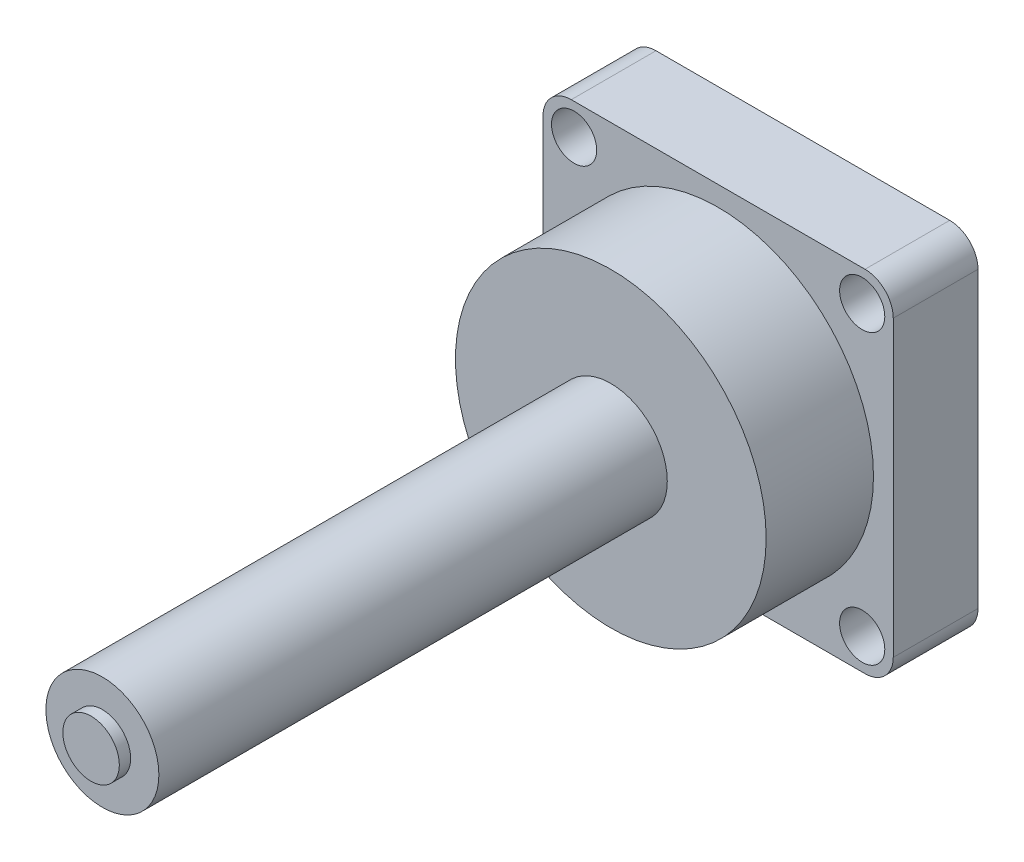
ISO-10303-21;
HEADER;
FILE_DESCRIPTION(('STEP AP214'),'2;1');
FILE_NAME('part.step','',(''),(''),'','','');
FILE_SCHEMA(('AUTOMOTIVE_DESIGN { 1 0 10303 214 1 1 1 1 }'));
ENDSEC;
DATA;
#1=APPLICATION_CONTEXT('core data for automotive mechanical design processes');
#2=APPLICATION_PROTOCOL_DEFINITION('international standard','automotive_design',2000,#1);
#3=PRODUCT_CONTEXT('',#1,'mechanical');
#4=PRODUCT('Part','Part','',(#3));
#5=PRODUCT_RELATED_PRODUCT_CATEGORY('part','',(#4));
#6=PRODUCT_DEFINITION_FORMATION('','',#4);
#7=PRODUCT_DEFINITION_CONTEXT('part definition',#1,'design');
#8=PRODUCT_DEFINITION('design','',#6,#7);
#9=PRODUCT_DEFINITION_SHAPE('','',#8);
#10=(LENGTH_UNIT() NAMED_UNIT(*) SI_UNIT(.MILLI.,.METRE.));
#11=(NAMED_UNIT(*) PLANE_ANGLE_UNIT() SI_UNIT($,.RADIAN.));
#12=(NAMED_UNIT(*) SI_UNIT($,.STERADIAN.) SOLID_ANGLE_UNIT());
#13=UNCERTAINTY_MEASURE_WITH_UNIT(LENGTH_MEASURE(1.E-05),#10,'distance_accuracy_value','');
#14=(GEOMETRIC_REPRESENTATION_CONTEXT(3) GLOBAL_UNCERTAINTY_ASSIGNED_CONTEXT((#13)) GLOBAL_UNIT_ASSIGNED_CONTEXT((#10,
#11,#12)) REPRESENTATION_CONTEXT('',''));
#15=CARTESIAN_POINT('',(0.,0.,0.));
#16=DIRECTION('',(0.,0.,1.));
#17=DIRECTION('',(1.,0.,0.));
#18=AXIS2_PLACEMENT_3D('',#15,#16,#17);
#19=CARTESIAN_POINT('',(0.,31.,15.));
#20=DIRECTION('',(0.,1.,0.));
#21=DIRECTION('',(0.,0.,1.));
#22=AXIS2_PLACEMENT_3D('',#19,#20,#21);
#23=PLANE('',#22);
#24=DIRECTION('',(1.,0.,0.));
#25=VECTOR('',#24,1.);
#26=CARTESIAN_POINT('',(0.,31.,0.));
#27=LINE('',#26,#25);
#28=CARTESIAN_POINT('',(-26.,31.,0.));
#29=VERTEX_POINT('',#28);
#30=CARTESIAN_POINT('',(26.,31.,0.));
#31=VERTEX_POINT('',#30);
#32=EDGE_CURVE('E167',#29,#31,#27,.T.);
#33=ORIENTED_EDGE('',*,*,#32,.F.);
#34=DIRECTION('',(0.,0.,-1.));
#35=VECTOR('',#34,1.);
#36=CARTESIAN_POINT('',(-26.,31.,15.));
#37=LINE('',#36,#35);
#38=CARTESIAN_POINT('',(-26.,31.,15.));
#39=VERTEX_POINT('',#38);
#40=EDGE_CURVE('E47',#39,#29,#37,.T.);
#41=ORIENTED_EDGE('',*,*,#40,.F.);
#42=DIRECTION('',(1.,0.,0.));
#43=VECTOR('',#42,1.);
#44=CARTESIAN_POINT('',(0.,31.,15.));
#45=LINE('',#44,#43);
#46=CARTESIAN_POINT('',(26.,31.,15.));
#47=VERTEX_POINT('',#46);
#48=EDGE_CURVE('E298',#39,#47,#45,.T.);
#49=ORIENTED_EDGE('',*,*,#48,.T.);
#50=DIRECTION('',(0.,0.,-1.));
#51=VECTOR('',#50,1.);
#52=CARTESIAN_POINT('',(26.,31.,15.));
#53=LINE('',#52,#51);
#54=EDGE_CURVE('E98',#47,#31,#53,.T.);
#55=ORIENTED_EDGE('',*,*,#54,.T.);
#56=EDGE_LOOP('',(#33,#41,#49,#55));
#57=FACE_BOUND('',#56,.T.);
#58=ADVANCED_FACE('F43',(#57),#23,.T.);
#59=CARTESIAN_POINT('',(-26.,26.,15.));
#60=DIRECTION('',(0.,0.,-1.));
#61=DIRECTION('',(-1.,0.,0.));
#62=AXIS2_PLACEMENT_3D('',#59,#60,#61);
#63=CYLINDRICAL_SURFACE('',#62,5.);
#64=CARTESIAN_POINT('',(-26.,26.,0.));
#65=DIRECTION('',(0.,0.,1.));
#66=DIRECTION('',(1.,0.,0.));
#67=AXIS2_PLACEMENT_3D('',#64,#65,#66);
#68=CIRCLE('',#67,5.);
#69=CARTESIAN_POINT('',(-31.,26.,0.));
#70=VERTEX_POINT('',#69);
#71=EDGE_CURVE('E170',#29,#70,#68,.T.);
#72=ORIENTED_EDGE('',*,*,#71,.T.);
#73=DIRECTION('',(0.,0.,-1.));
#74=VECTOR('',#73,1.);
#75=CARTESIAN_POINT('',(-31.,26.,15.));
#76=LINE('',#75,#74);
#77=CARTESIAN_POINT('',(-31.,26.,15.));
#78=VERTEX_POINT('',#77);
#79=EDGE_CURVE('E214',#78,#70,#76,.T.);
#80=ORIENTED_EDGE('',*,*,#79,.F.);
#81=CARTESIAN_POINT('',(-26.,26.,15.));
#82=DIRECTION('',(0.,0.,1.));
#83=DIRECTION('',(1.,0.,0.));
#84=AXIS2_PLACEMENT_3D('',#81,#82,#83);
#85=CIRCLE('',#84,5.);
#86=EDGE_CURVE('E224',#39,#78,#85,.T.);
#87=ORIENTED_EDGE('',*,*,#86,.F.);
#88=ORIENTED_EDGE('',*,*,#40,.T.);
#89=EDGE_LOOP('',(#72,#80,#87,#88));
#90=FACE_BOUND('',#89,.T.);
#91=ADVANCED_FACE('F223',(#90),#63,.T.);
#92=CARTESIAN_POINT('',(-31.,0.,15.));
#93=DIRECTION('',(-1.,0.,0.));
#94=DIRECTION('',(0.,0.,1.));
#95=AXIS2_PLACEMENT_3D('',#92,#93,#94);
#96=PLANE('',#95);
#97=DIRECTION('',(0.,1.,0.));
#98=VECTOR('',#97,1.);
#99=CARTESIAN_POINT('',(-31.,0.,0.));
#100=LINE('',#99,#98);
#101=CARTESIAN_POINT('',(-31.,-26.,0.));
#102=VERTEX_POINT('',#101);
#103=EDGE_CURVE('E174',#102,#70,#100,.T.);
#104=ORIENTED_EDGE('',*,*,#103,.F.);
#105=DIRECTION('',(0.,0.,-1.));
#106=VECTOR('',#105,1.);
#107=CARTESIAN_POINT('',(-31.,-26.,15.));
#108=LINE('',#107,#106);
#109=CARTESIAN_POINT('',(-31.,-26.,15.));
#110=VERTEX_POINT('',#109);
#111=EDGE_CURVE('E212',#110,#102,#108,.T.);
#112=ORIENTED_EDGE('',*,*,#111,.F.);
#113=DIRECTION('',(0.,1.,0.));
#114=VECTOR('',#113,1.);
#115=CARTESIAN_POINT('',(-31.,0.,15.));
#116=LINE('',#115,#114);
#117=EDGE_CURVE('E292',#110,#78,#116,.T.);
#118=ORIENTED_EDGE('',*,*,#117,.T.);
#119=ORIENTED_EDGE('',*,*,#79,.T.);
#120=EDGE_LOOP('',(#104,#112,#118,#119));
#121=FACE_BOUND('',#120,.T.);
#122=ADVANCED_FACE('F233',(#121),#96,.T.);
#123=CARTESIAN_POINT('',(-26.,-26.,15.));
#124=DIRECTION('',(0.,0.,-1.));
#125=DIRECTION('',(-1.,0.,0.));
#126=AXIS2_PLACEMENT_3D('',#123,#124,#125);
#127=CYLINDRICAL_SURFACE('',#126,5.);
#128=CARTESIAN_POINT('',(-26.,-26.,0.));
#129=DIRECTION('',(0.,0.,1.));
#130=DIRECTION('',(1.,0.,0.));
#131=AXIS2_PLACEMENT_3D('',#128,#129,#130);
#132=CIRCLE('',#131,5.);
#133=CARTESIAN_POINT('',(-26.,-31.,0.));
#134=VERTEX_POINT('',#133);
#135=EDGE_CURVE('E178',#102,#134,#132,.T.);
#136=ORIENTED_EDGE('',*,*,#135,.T.);
#137=DIRECTION('',(0.,0.,-1.));
#138=VECTOR('',#137,1.);
#139=CARTESIAN_POINT('',(-26.,-31.,15.));
#140=LINE('',#139,#138);
#141=CARTESIAN_POINT('',(-26.,-31.,15.));
#142=VERTEX_POINT('',#141);
#143=EDGE_CURVE('E208',#142,#134,#140,.T.);
#144=ORIENTED_EDGE('',*,*,#143,.F.);
#145=CARTESIAN_POINT('',(-26.,-26.,15.));
#146=DIRECTION('',(0.,0.,1.));
#147=DIRECTION('',(1.,0.,0.));
#148=AXIS2_PLACEMENT_3D('',#145,#146,#147);
#149=CIRCLE('',#148,5.);
#150=EDGE_CURVE('E144',#110,#142,#149,.T.);
#151=ORIENTED_EDGE('',*,*,#150,.F.);
#152=ORIENTED_EDGE('',*,*,#111,.T.);
#153=EDGE_LOOP('',(#136,#144,#151,#152));
#154=FACE_BOUND('',#153,.T.);
#155=ADVANCED_FACE('F283',(#154),#127,.T.);
#156=CARTESIAN_POINT('',(0.,-31.,15.));
#157=DIRECTION('',(0.,1.,0.));
#158=DIRECTION('',(0.,0.,1.));
#159=AXIS2_PLACEMENT_3D('',#156,#157,#158);
#160=PLANE('',#159);
#161=DIRECTION('',(1.,0.,0.));
#162=VECTOR('',#161,1.);
#163=CARTESIAN_POINT('',(0.,-31.,0.));
#164=LINE('',#163,#162);
#165=CARTESIAN_POINT('',(26.,-31.,0.));
#166=VERTEX_POINT('',#165);
#167=EDGE_CURVE('E182',#134,#166,#164,.T.);
#168=ORIENTED_EDGE('',*,*,#167,.T.);
#169=DIRECTION('',(0.,0.,-1.));
#170=VECTOR('',#169,1.);
#171=CARTESIAN_POINT('',(26.,-31.,15.));
#172=LINE('',#171,#170);
#173=CARTESIAN_POINT('',(26.,-31.,15.));
#174=VERTEX_POINT('',#173);
#175=EDGE_CURVE('E128',#174,#166,#172,.T.);
#176=ORIENTED_EDGE('',*,*,#175,.F.);
#177=DIRECTION('',(1.,0.,0.));
#178=VECTOR('',#177,1.);
#179=CARTESIAN_POINT('',(0.,-31.,15.));
#180=LINE('',#179,#178);
#181=EDGE_CURVE('E139',#142,#174,#180,.T.);
#182=ORIENTED_EDGE('',*,*,#181,.F.);
#183=ORIENTED_EDGE('',*,*,#143,.T.);
#184=EDGE_LOOP('',(#168,#176,#182,#183));
#185=FACE_BOUND('',#184,.T.);
#186=ADVANCED_FACE('F280',(#185),#160,.F.);
#187=CARTESIAN_POINT('',(26.,-26.,15.));
#188=DIRECTION('',(0.,0.,-1.));
#189=DIRECTION('',(-1.,0.,0.));
#190=AXIS2_PLACEMENT_3D('',#187,#188,#189);
#191=CYLINDRICAL_SURFACE('',#190,5.);
#192=CARTESIAN_POINT('',(26.,-26.,0.));
#193=DIRECTION('',(0.,0.,1.));
#194=DIRECTION('',(1.,0.,0.));
#195=AXIS2_PLACEMENT_3D('',#192,#193,#194);
#196=CIRCLE('',#195,5.);
#197=CARTESIAN_POINT('',(31.,-26.,0.));
#198=VERTEX_POINT('',#197);
#199=EDGE_CURVE('E124',#198,#166,#196,.F.);
#200=ORIENTED_EDGE('',*,*,#199,.F.);
#201=DIRECTION('',(0.,0.,-1.));
#202=VECTOR('',#201,1.);
#203=CARTESIAN_POINT('',(31.,-26.,15.));
#204=LINE('',#203,#202);
#205=CARTESIAN_POINT('',(31.,-26.,15.));
#206=VERTEX_POINT('',#205);
#207=EDGE_CURVE('E118',#206,#198,#204,.T.);
#208=ORIENTED_EDGE('',*,*,#207,.F.);
#209=CARTESIAN_POINT('',(26.,-26.,15.));
#210=DIRECTION('',(0.,0.,1.));
#211=DIRECTION('',(1.,0.,0.));
#212=AXIS2_PLACEMENT_3D('',#209,#210,#211);
#213=CIRCLE('',#212,5.);
#214=EDGE_CURVE('E122',#206,#174,#213,.F.);
#215=ORIENTED_EDGE('',*,*,#214,.T.);
#216=ORIENTED_EDGE('',*,*,#175,.T.);
#217=EDGE_LOOP('',(#200,#208,#215,#216));
#218=FACE_BOUND('',#217,.T.);
#219=ADVANCED_FACE('F120',(#218),#191,.T.);
#220=CARTESIAN_POINT('',(31.,0.,15.));
#221=DIRECTION('',(-1.,0.,0.));
#222=DIRECTION('',(0.,0.,1.));
#223=AXIS2_PLACEMENT_3D('',#220,#221,#222);
#224=PLANE('',#223);
#225=DIRECTION('',(0.,1.,0.));
#226=VECTOR('',#225,1.);
#227=CARTESIAN_POINT('',(31.,0.,0.));
#228=LINE('',#227,#226);
#229=CARTESIAN_POINT('',(31.,26.,0.));
#230=VERTEX_POINT('',#229);
#231=EDGE_CURVE('E188',#198,#230,#228,.T.);
#232=ORIENTED_EDGE('',*,*,#231,.T.);
#233=DIRECTION('',(0.,0.,-1.));
#234=VECTOR('',#233,1.);
#235=CARTESIAN_POINT('',(31.,26.,15.));
#236=LINE('',#235,#234);
#237=CARTESIAN_POINT('',(31.,26.,15.));
#238=VERTEX_POINT('',#237);
#239=EDGE_CURVE('E129',#238,#230,#236,.T.);
#240=ORIENTED_EDGE('',*,*,#239,.F.);
#241=DIRECTION('',(0.,1.,0.));
#242=VECTOR('',#241,1.);
#243=CARTESIAN_POINT('',(31.,0.,15.));
#244=LINE('',#243,#242);
#245=EDGE_CURVE('E132',#206,#238,#244,.T.);
#246=ORIENTED_EDGE('',*,*,#245,.F.);
#247=ORIENTED_EDGE('',*,*,#207,.T.);
#248=EDGE_LOOP('',(#232,#240,#246,#247));
#249=FACE_BOUND('',#248,.T.);
#250=ADVANCED_FACE('F133',(#249),#224,.F.);
#251=CARTESIAN_POINT('',(-25.5,-25.5,15.));
#252=DIRECTION('',(0.,0.,-1.));
#253=DIRECTION('',(-1.,0.,0.));
#254=AXIS2_PLACEMENT_3D('',#251,#252,#253);
#255=CYLINDRICAL_SURFACE('',#254,4.);
#256=CARTESIAN_POINT('',(-25.5,-25.5,15.));
#257=DIRECTION('',(0.,0.,1.));
#258=DIRECTION('',(1.,0.,0.));
#259=AXIS2_PLACEMENT_3D('',#256,#257,#258);
#260=CIRCLE('',#259,4.);
#261=CARTESIAN_POINT('',(-21.5,-25.5,15.));
#262=VERTEX_POINT('',#261);
#263=EDGE_CURVE('E150',#262,#262,#260,.T.);
#264=ORIENTED_EDGE('',*,*,#263,.T.);
#265=EDGE_LOOP('',(#264));
#266=FACE_BOUND('',#265,.T.);
#267=CARTESIAN_POINT('',(-25.5,-25.5,0.));
#268=DIRECTION('',(0.,0.,1.));
#269=DIRECTION('',(1.,0.,0.));
#270=AXIS2_PLACEMENT_3D('',#267,#268,#269);
#271=CIRCLE('',#270,4.);
#272=CARTESIAN_POINT('',(-21.5,-25.5,0.));
#273=VERTEX_POINT('',#272);
#274=EDGE_CURVE('E193',#273,#273,#271,.T.);
#275=ORIENTED_EDGE('',*,*,#274,.F.);
#276=EDGE_LOOP('',(#275));
#277=FACE_BOUND('',#276,.T.);
#278=ADVANCED_FACE('F246',(#266,#277),#255,.F.);
#279=CARTESIAN_POINT('',(26.,26.,15.));
#280=DIRECTION('',(0.,0.,-1.));
#281=DIRECTION('',(-1.,0.,0.));
#282=AXIS2_PLACEMENT_3D('',#279,#280,#281);
#283=CYLINDRICAL_SURFACE('',#282,5.);
#284=CARTESIAN_POINT('',(26.,26.,0.));
#285=DIRECTION('',(0.,0.,1.));
#286=DIRECTION('',(1.,0.,0.));
#287=AXIS2_PLACEMENT_3D('',#284,#285,#286);
#288=CIRCLE('',#287,5.);
#289=EDGE_CURVE('E91',#230,#31,#288,.T.);
#290=ORIENTED_EDGE('',*,*,#289,.T.);
#291=ORIENTED_EDGE('',*,*,#54,.F.);
#292=CARTESIAN_POINT('',(26.,26.,15.));
#293=DIRECTION('',(0.,0.,1.));
#294=DIRECTION('',(1.,0.,0.));
#295=AXIS2_PLACEMENT_3D('',#292,#293,#294);
#296=CIRCLE('',#295,5.);
#297=EDGE_CURVE('E62',#238,#47,#296,.T.);
#298=ORIENTED_EDGE('',*,*,#297,.F.);
#299=ORIENTED_EDGE('',*,*,#239,.T.);
#300=EDGE_LOOP('',(#290,#291,#298,#299));
#301=FACE_BOUND('',#300,.T.);
#302=ADVANCED_FACE('F238',(#301),#283,.T.);
#303=CARTESIAN_POINT('',(25.5,25.5,15.));
#304=DIRECTION('',(0.,0.,-1.));
#305=DIRECTION('',(-1.,0.,0.));
#306=AXIS2_PLACEMENT_3D('',#303,#304,#305);
#307=CYLINDRICAL_SURFACE('',#306,4.);
#308=CARTESIAN_POINT('',(25.5,25.5,15.));
#309=DIRECTION('',(0.,0.,1.));
#310=DIRECTION('',(1.,0.,0.));
#311=AXIS2_PLACEMENT_3D('',#308,#309,#310);
#312=CIRCLE('',#311,4.);
#313=CARTESIAN_POINT('',(29.5,25.5,15.));
#314=VERTEX_POINT('',#313);
#315=EDGE_CURVE('E252',#314,#314,#312,.T.);
#316=ORIENTED_EDGE('',*,*,#315,.T.);
#317=EDGE_LOOP('',(#316));
#318=FACE_BOUND('',#317,.T.);
#319=CARTESIAN_POINT('',(25.5,25.5,0.));
#320=DIRECTION('',(0.,0.,1.));
#321=DIRECTION('',(1.,0.,0.));
#322=AXIS2_PLACEMENT_3D('',#319,#320,#321);
#323=CIRCLE('',#322,4.);
#324=CARTESIAN_POINT('',(29.5,25.5,0.));
#325=VERTEX_POINT('',#324);
#326=EDGE_CURVE('E162',#325,#325,#323,.T.);
#327=ORIENTED_EDGE('',*,*,#326,.F.);
#328=EDGE_LOOP('',(#327));
#329=FACE_BOUND('',#328,.T.);
#330=ADVANCED_FACE('F236',(#318,#329),#307,.F.);
#331=CARTESIAN_POINT('',(-25.5,25.5,15.));
#332=DIRECTION('',(0.,0.,-1.));
#333=DIRECTION('',(-1.,0.,0.));
#334=AXIS2_PLACEMENT_3D('',#331,#332,#333);
#335=CYLINDRICAL_SURFACE('',#334,4.);
#336=CARTESIAN_POINT('',(-25.5,25.5,15.));
#337=DIRECTION('',(0.,0.,1.));
#338=DIRECTION('',(1.,0.,0.));
#339=AXIS2_PLACEMENT_3D('',#336,#337,#338);
#340=CIRCLE('',#339,4.);
#341=CARTESIAN_POINT('',(-21.5,25.5,15.));
#342=VERTEX_POINT('',#341);
#343=EDGE_CURVE('E305',#342,#342,#340,.F.);
#344=ORIENTED_EDGE('',*,*,#343,.F.);
#345=EDGE_LOOP('',(#344));
#346=FACE_BOUND('',#345,.T.);
#347=CARTESIAN_POINT('',(-25.5,25.5,0.));
#348=DIRECTION('',(0.,0.,1.));
#349=DIRECTION('',(1.,0.,0.));
#350=AXIS2_PLACEMENT_3D('',#347,#348,#349);
#351=CIRCLE('',#350,4.);
#352=CARTESIAN_POINT('',(-21.5,25.5,0.));
#353=VERTEX_POINT('',#352);
#354=EDGE_CURVE('E158',#353,#353,#351,.F.);
#355=ORIENTED_EDGE('',*,*,#354,.T.);
#356=EDGE_LOOP('',(#355));
#357=FACE_BOUND('',#356,.T.);
#358=ADVANCED_FACE('F45',(#346,#357),#335,.F.);
#359=CARTESIAN_POINT('',(25.5,-25.5,15.));
#360=DIRECTION('',(0.,0.,-1.));
#361=DIRECTION('',(-1.,0.,0.));
#362=AXIS2_PLACEMENT_3D('',#359,#360,#361);
#363=CYLINDRICAL_SURFACE('',#362,4.);
#364=CARTESIAN_POINT('',(25.5,-25.5,15.));
#365=DIRECTION('',(0.,0.,1.));
#366=DIRECTION('',(1.,0.,0.));
#367=AXIS2_PLACEMENT_3D('',#364,#365,#366);
#368=CIRCLE('',#367,4.);
#369=CARTESIAN_POINT('',(29.5,-25.5,15.));
#370=VERTEX_POINT('',#369);
#371=EDGE_CURVE('E154',#370,#370,#368,.F.);
#372=ORIENTED_EDGE('',*,*,#371,.F.);
#373=EDGE_LOOP('',(#372));
#374=FACE_BOUND('',#373,.T.);
#375=CARTESIAN_POINT('',(25.5,-25.5,0.));
#376=DIRECTION('',(0.,0.,1.));
#377=DIRECTION('',(1.,0.,0.));
#378=AXIS2_PLACEMENT_3D('',#375,#376,#377);
#379=CIRCLE('',#378,4.);
#380=CARTESIAN_POINT('',(29.5,-25.5,0.));
#381=VERTEX_POINT('',#380);
#382=EDGE_CURVE('E197',#381,#381,#379,.F.);
#383=ORIENTED_EDGE('',*,*,#382,.T.);
#384=EDGE_LOOP('',(#383));
#385=FACE_BOUND('',#384,.T.);
#386=ADVANCED_FACE('F244',(#374,#385),#363,.F.);
#387=CARTESIAN_POINT('',(0.,0.,15.));
#388=DIRECTION('',(0.,0.,1.));
#389=DIRECTION('',(1.,0.,0.));
#390=AXIS2_PLACEMENT_3D('',#387,#388,#389);
#391=PLANE('',#390);
#392=CARTESIAN_POINT('',(0.,0.,15.));
#393=DIRECTION('',(0.,0.,1.));
#394=DIRECTION('',(1.,0.,0.));
#395=AXIS2_PLACEMENT_3D('',#392,#393,#394);
#396=CIRCLE('',#395,27.5);
#397=CARTESIAN_POINT('',(27.5,0.,15.));
#398=VERTEX_POINT('',#397);
#399=EDGE_CURVE('E201',#398,#398,#396,.T.);
#400=ORIENTED_EDGE('',*,*,#399,.F.);
#401=EDGE_LOOP('',(#400));
#402=FACE_BOUND('',#401,.T.);
#403=ORIENTED_EDGE('',*,*,#343,.T.);
#404=EDGE_LOOP('',(#403));
#405=FACE_BOUND('',#404,.T.);
#406=ORIENTED_EDGE('',*,*,#315,.F.);
#407=EDGE_LOOP('',(#406));
#408=FACE_BOUND('',#407,.T.);
#409=ORIENTED_EDGE('',*,*,#48,.F.);
#410=ORIENTED_EDGE('',*,*,#86,.T.);
#411=ORIENTED_EDGE('',*,*,#117,.F.);
#412=ORIENTED_EDGE('',*,*,#150,.T.);
#413=ORIENTED_EDGE('',*,*,#181,.T.);
#414=ORIENTED_EDGE('',*,*,#214,.F.);
#415=ORIENTED_EDGE('',*,*,#245,.T.);
#416=ORIENTED_EDGE('',*,*,#297,.T.);
#417=EDGE_LOOP('',(#409,#410,#411,#412,#413,#414,#415,#416));
#418=FACE_BOUND('',#417,.T.);
#419=ORIENTED_EDGE('',*,*,#263,.F.);
#420=EDGE_LOOP('',(#419));
#421=FACE_BOUND('',#420,.T.);
#422=ORIENTED_EDGE('',*,*,#371,.T.);
#423=EDGE_LOOP('',(#422));
#424=FACE_BOUND('',#423,.T.);
#425=ADVANCED_FACE('F136',(#402,#405,#408,#418,#421,#424),#391,.T.);
#426=CARTESIAN_POINT('',(0.,0.,0.));
#427=DIRECTION('',(0.,0.,1.));
#428=DIRECTION('',(1.,0.,0.));
#429=AXIS2_PLACEMENT_3D('',#426,#427,#428);
#430=PLANE('',#429);
#431=ORIENTED_EDGE('',*,*,#354,.F.);
#432=EDGE_LOOP('',(#431));
#433=FACE_BOUND('',#432,.T.);
#434=ORIENTED_EDGE('',*,*,#326,.T.);
#435=EDGE_LOOP('',(#434));
#436=FACE_BOUND('',#435,.T.);
#437=ORIENTED_EDGE('',*,*,#32,.T.);
#438=ORIENTED_EDGE('',*,*,#289,.F.);
#439=ORIENTED_EDGE('',*,*,#231,.F.);
#440=ORIENTED_EDGE('',*,*,#199,.T.);
#441=ORIENTED_EDGE('',*,*,#167,.F.);
#442=ORIENTED_EDGE('',*,*,#135,.F.);
#443=ORIENTED_EDGE('',*,*,#103,.T.);
#444=ORIENTED_EDGE('',*,*,#71,.F.);
#445=EDGE_LOOP('',(#437,#438,#439,#440,#441,#442,#443,#444));
#446=FACE_BOUND('',#445,.T.);
#447=ORIENTED_EDGE('',*,*,#274,.T.);
#448=EDGE_LOOP('',(#447));
#449=FACE_BOUND('',#448,.T.);
#450=ORIENTED_EDGE('',*,*,#382,.F.);
#451=EDGE_LOOP('',(#450));
#452=FACE_BOUND('',#451,.T.);
#453=ADVANCED_FACE('F225',(#433,#436,#446,#449,#452),#430,.F.);
#454=CARTESIAN_POINT('',(0.,0.,34.));
#455=DIRECTION('',(0.,0.,-1.));
#456=DIRECTION('',(-1.,0.,0.));
#457=AXIS2_PLACEMENT_3D('',#454,#455,#456);
#458=CYLINDRICAL_SURFACE('',#457,27.5);
#459=ORIENTED_EDGE('',*,*,#399,.T.);
#460=EDGE_LOOP('',(#459));
#461=FACE_BOUND('',#460,.T.);
#462=CARTESIAN_POINT('',(0.,0.,34.));
#463=DIRECTION('',(0.,0.,1.));
#464=DIRECTION('',(1.,0.,0.));
#465=AXIS2_PLACEMENT_3D('',#462,#463,#464);
#466=CIRCLE('',#465,27.5);
#467=CARTESIAN_POINT('',(27.5,0.,34.));
#468=VERTEX_POINT('',#467);
#469=EDGE_CURVE('E163',#468,#468,#466,.T.);
#470=ORIENTED_EDGE('',*,*,#469,.F.);
#471=EDGE_LOOP('',(#470));
#472=FACE_BOUND('',#471,.T.);
#473=ADVANCED_FACE('F256',(#461,#472),#458,.T.);
#474=CARTESIAN_POINT('',(0.,0.,34.));
#475=DIRECTION('',(0.,0.,1.));
#476=DIRECTION('',(1.,0.,0.));
#477=AXIS2_PLACEMENT_3D('',#474,#475,#476);
#478=PLANE('',#477);
#479=CARTESIAN_POINT('',(0.,0.,34.));
#480=DIRECTION('',(0.,0.,1.));
#481=DIRECTION('',(1.,0.,0.));
#482=AXIS2_PLACEMENT_3D('',#479,#480,#481);
#483=CIRCLE('',#482,10.);
#484=CARTESIAN_POINT('',(10.,0.,34.));
#485=VERTEX_POINT('',#484);
#486=EDGE_CURVE('E315',#485,#485,#483,.T.);
#487=ORIENTED_EDGE('',*,*,#486,.F.);
#488=EDGE_LOOP('',(#487));
#489=FACE_BOUND('',#488,.T.);
#490=ORIENTED_EDGE('',*,*,#469,.T.);
#491=EDGE_LOOP('',(#490));
#492=FACE_BOUND('',#491,.T.);
#493=ADVANCED_FACE('F263',(#489,#492),#478,.T.);
#494=CARTESIAN_POINT('',(0.,0.,124.));
#495=DIRECTION('',(0.,0.,1.));
#496=DIRECTION('',(1.,0.,0.));
#497=AXIS2_PLACEMENT_3D('',#494,#495,#496);
#498=PLANE('',#497);
#499=CARTESIAN_POINT('',(0.,0.,124.));
#500=DIRECTION('',(0.,0.,1.));
#501=DIRECTION('',(1.,0.,0.));
#502=AXIS2_PLACEMENT_3D('',#499,#500,#501);
#503=CIRCLE('',#502,5.);
#504=CARTESIAN_POINT('',(5.,0.,124.));
#505=VERTEX_POINT('',#504);
#506=EDGE_CURVE('E11',#505,#505,#503,.T.);
#507=ORIENTED_EDGE('',*,*,#506,.F.);
#508=EDGE_LOOP('',(#507));
#509=FACE_BOUND('',#508,.T.);
#510=CARTESIAN_POINT('',(0.,0.,124.));
#511=DIRECTION('',(0.,0.,1.));
#512=DIRECTION('',(1.,0.,0.));
#513=AXIS2_PLACEMENT_3D('',#510,#511,#512);
#514=CIRCLE('',#513,10.);
#515=CARTESIAN_POINT('',(10.,0.,124.));
#516=VERTEX_POINT('',#515);
#517=EDGE_CURVE('E319',#516,#516,#514,.T.);
#518=ORIENTED_EDGE('',*,*,#517,.T.);
#519=EDGE_LOOP('',(#518));
#520=FACE_BOUND('',#519,.T.);
#521=ADVANCED_FACE('F337',(#509,#520),#498,.T.);
#522=CARTESIAN_POINT('',(0.,0.,124.));
#523=DIRECTION('',(0.,0.,-1.));
#524=DIRECTION('',(-1.,0.,0.));
#525=AXIS2_PLACEMENT_3D('',#522,#523,#524);
#526=CYLINDRICAL_SURFACE('',#525,10.);
#527=ORIENTED_EDGE('',*,*,#486,.T.);
#528=EDGE_LOOP('',(#527));
#529=FACE_BOUND('',#528,.T.);
#530=ORIENTED_EDGE('',*,*,#517,.F.);
#531=EDGE_LOOP('',(#530));
#532=FACE_BOUND('',#531,.T.);
#533=ADVANCED_FACE('F333',(#529,#532),#526,.T.);
#534=CARTESIAN_POINT('',(0.,0.,126.));
#535=DIRECTION('',(0.,0.,-1.));
#536=DIRECTION('',(-1.,0.,0.));
#537=AXIS2_PLACEMENT_3D('',#534,#535,#536);
#538=CYLINDRICAL_SURFACE('',#537,5.);
#539=CARTESIAN_POINT('',(0.,0.,126.));
#540=DIRECTION('',(0.,0.,1.));
#541=DIRECTION('',(1.,0.,0.));
#542=AXIS2_PLACEMENT_3D('',#539,#540,#541);
#543=CIRCLE('',#542,5.);
#544=CARTESIAN_POINT('',(5.,0.,126.));
#545=VERTEX_POINT('',#544);
#546=EDGE_CURVE('E322',#545,#545,#543,.T.);
#547=ORIENTED_EDGE('',*,*,#546,.F.);
#548=EDGE_LOOP('',(#547));
#549=FACE_BOUND('',#548,.T.);
#550=ORIENTED_EDGE('',*,*,#506,.T.);
#551=EDGE_LOOP('',(#550));
#552=FACE_BOUND('',#551,.T.);
#553=ADVANCED_FACE('F330',(#549,#552),#538,.T.);
#554=CARTESIAN_POINT('',(0.,0.,126.));
#555=DIRECTION('',(0.,0.,1.));
#556=DIRECTION('',(1.,0.,0.));
#557=AXIS2_PLACEMENT_3D('',#554,#555,#556);
#558=PLANE('',#557);
#559=ORIENTED_EDGE('',*,*,#546,.T.);
#560=EDGE_LOOP('',(#559));
#561=FACE_BOUND('',#560,.T.);
#562=ADVANCED_FACE('F328',(#561),#558,.T.);
#563=CLOSED_SHELL('',(#58,#91,#122,#155,#186,#219,#250,#278,#302,#330,#358,#386,#425,#453,#473,
#493,#521,#533,#553,#562));
#564=MANIFOLD_SOLID_BREP('B2',#563);
#565=ADVANCED_BREP_SHAPE_REPRESENTATION('',(#18,#564),#14);
#566=SHAPE_DEFINITION_REPRESENTATION(#9,#565);
ENDSEC;
END-ISO-10303-21;
